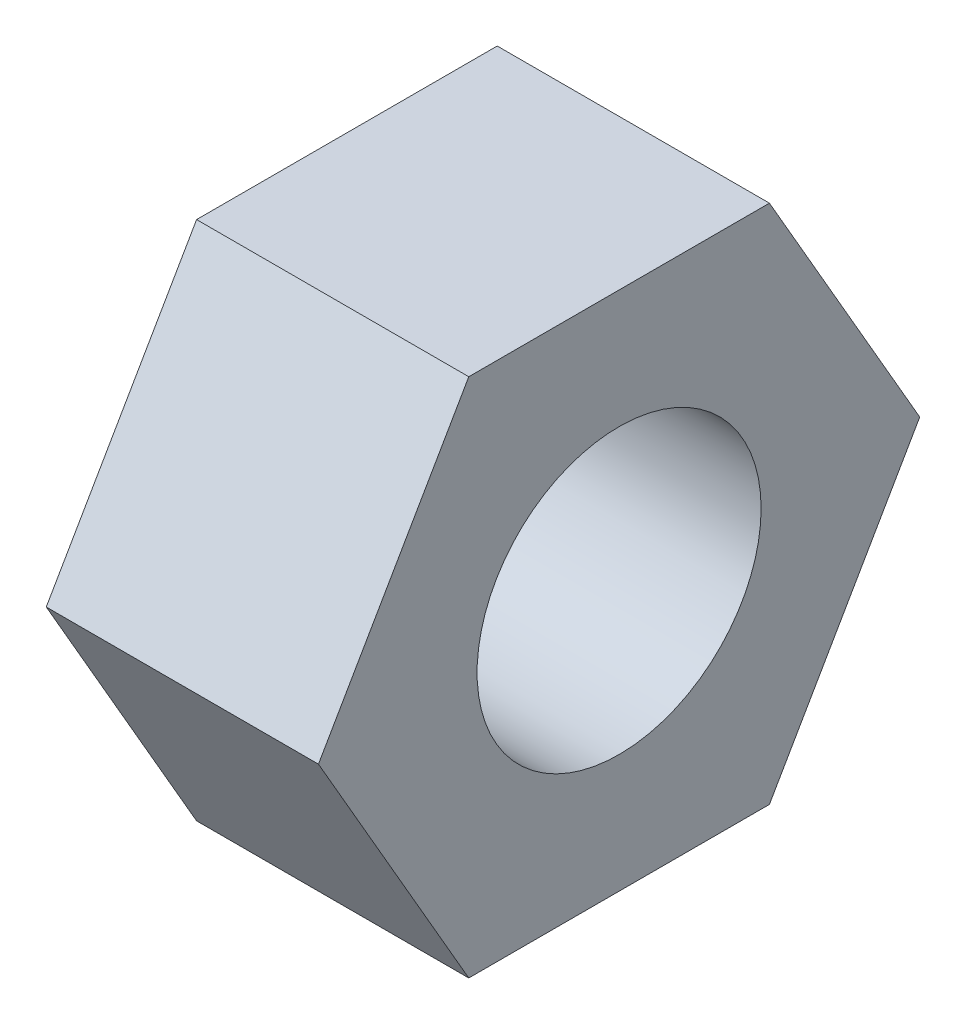
ISO-10303-21;
HEADER;
FILE_DESCRIPTION(('STEP AP214'),'2;1');
FILE_NAME('part.step','',(''),(''),'','','');
FILE_SCHEMA(('AUTOMOTIVE_DESIGN { 1 0 10303 214 1 1 1 1 }'));
ENDSEC;
DATA;
#1=APPLICATION_CONTEXT('core data for automotive mechanical design processes');
#2=APPLICATION_PROTOCOL_DEFINITION('international standard','automotive_design',2000,#1);
#3=PRODUCT_CONTEXT('',#1,'mechanical');
#4=PRODUCT('Part','Part','',(#3));
#5=PRODUCT_RELATED_PRODUCT_CATEGORY('part','',(#4));
#6=PRODUCT_DEFINITION_FORMATION('','',#4);
#7=PRODUCT_DEFINITION_CONTEXT('part definition',#1,'design');
#8=PRODUCT_DEFINITION('design','',#6,#7);
#9=PRODUCT_DEFINITION_SHAPE('','',#8);
#10=(LENGTH_UNIT() NAMED_UNIT(*) SI_UNIT(.MILLI.,.METRE.));
#11=(NAMED_UNIT(*) PLANE_ANGLE_UNIT() SI_UNIT($,.RADIAN.));
#12=(NAMED_UNIT(*) SI_UNIT($,.STERADIAN.) SOLID_ANGLE_UNIT());
#13=UNCERTAINTY_MEASURE_WITH_UNIT(LENGTH_MEASURE(1.E-05),#10,'distance_accuracy_value','');
#14=(GEOMETRIC_REPRESENTATION_CONTEXT(3) GLOBAL_UNCERTAINTY_ASSIGNED_CONTEXT((#13)) GLOBAL_UNIT_ASSIGNED_CONTEXT((#10,
#11,#12)) REPRESENTATION_CONTEXT('',''));
#15=CARTESIAN_POINT('',(0.,0.,0.));
#16=DIRECTION('',(0.,0.,1.));
#17=DIRECTION('',(1.,0.,0.));
#18=AXIS2_PLACEMENT_3D('',#15,#16,#17);
#19=CARTESIAN_POINT('',(9.128125,0.,10.0819790757238));
#20=DIRECTION('',(1.,0.,0.));
#21=DIRECTION('',(0.,0.,-1.));
#22=AXIS2_PLACEMENT_3D('',#19,#20,#21);
#23=PLANE('',#22);
#24=DIRECTION('',(0.,-0.866025403784439,0.5));
#25=VECTOR('',#24,1.);
#26=CARTESIAN_POINT('',(9.128125,8.73125,5.04098953786192));
#27=LINE('',#26,#25);
#28=CARTESIAN_POINT('',(9.128125,8.73125,5.04098953786192));
#29=VERTEX_POINT('',#28);
#30=CARTESIAN_POINT('',(9.128125,0.,10.0819790757238));
#31=VERTEX_POINT('',#30);
#32=EDGE_CURVE('E127',#29,#31,#27,.T.);
#33=ORIENTED_EDGE('',*,*,#32,.T.);
#34=DIRECTION('',(0.,-0.866025403784439,-0.5));
#35=VECTOR('',#34,1.);
#36=CARTESIAN_POINT('',(9.128125,0.,10.0819790757238));
#37=LINE('',#36,#35);
#38=CARTESIAN_POINT('',(9.128125,-8.73125,5.04098953786192));
#39=VERTEX_POINT('',#38);
#40=EDGE_CURVE('E85',#31,#39,#37,.T.);
#41=ORIENTED_EDGE('',*,*,#40,.T.);
#42=DIRECTION('',(0.,0.,-1.));
#43=VECTOR('',#42,1.);
#44=CARTESIAN_POINT('',(9.128125,-8.73125,5.04098953786192));
#45=LINE('',#44,#43);
#46=CARTESIAN_POINT('',(9.128125,-8.73125,-5.04098953786192));
#47=VERTEX_POINT('',#46);
#48=EDGE_CURVE('E98',#39,#47,#45,.T.);
#49=ORIENTED_EDGE('',*,*,#48,.T.);
#50=DIRECTION('',(0.,0.866025403784439,-0.5));
#51=VECTOR('',#50,1.);
#52=CARTESIAN_POINT('',(9.128125,-8.73125,-5.04098953786192));
#53=LINE('',#52,#51);
#54=CARTESIAN_POINT('',(9.128125,0.,-10.0819790757238));
#55=VERTEX_POINT('',#54);
#56=EDGE_CURVE('E92',#47,#55,#53,.T.);
#57=ORIENTED_EDGE('',*,*,#56,.T.);
#58=DIRECTION('',(0.,0.866025403784439,0.5));
#59=VECTOR('',#58,1.);
#60=CARTESIAN_POINT('',(9.128125,0.,-10.0819790757238));
#61=LINE('',#60,#59);
#62=CARTESIAN_POINT('',(9.128125,8.73125,-5.04098953786192));
#63=VERTEX_POINT('',#62);
#64=EDGE_CURVE('E96',#55,#63,#61,.T.);
#65=ORIENTED_EDGE('',*,*,#64,.T.);
#66=DIRECTION('',(0.,0.,1.));
#67=VECTOR('',#66,1.);
#68=CARTESIAN_POINT('',(9.128125,8.73125,-5.04098953786192));
#69=LINE('',#68,#67);
#70=EDGE_CURVE('E48',#63,#29,#69,.T.);
#71=ORIENTED_EDGE('',*,*,#70,.T.);
#72=EDGE_LOOP('',(#33,#41,#49,#57,#65,#71));
#73=FACE_BOUND('',#72,.T.);
#74=CARTESIAN_POINT('',(9.128125,0.,0.));
#75=DIRECTION('',(1.,0.,0.));
#76=DIRECTION('',(0.,0.,-1.));
#77=AXIS2_PLACEMENT_3D('',#74,#75,#76);
#78=CIRCLE('',#77,4.7625);
#79=CARTESIAN_POINT('',(9.128125,0.,-4.7625));
#80=VERTEX_POINT('',#79);
#81=EDGE_CURVE('E120',#80,#80,#78,.T.);
#82=ORIENTED_EDGE('',*,*,#81,.F.);
#83=EDGE_LOOP('',(#82));
#84=FACE_BOUND('',#83,.T.);
#85=ADVANCED_FACE('F31',(#73,#84),#23,.T.);
#86=CARTESIAN_POINT('',(0.,0.,10.0819790757238));
#87=DIRECTION('',(1.,0.,0.));
#88=DIRECTION('',(0.,0.,-1.));
#89=AXIS2_PLACEMENT_3D('',#86,#87,#88);
#90=PLANE('',#89);
#91=DIRECTION('',(0.,-0.866025403784439,0.5));
#92=VECTOR('',#91,1.);
#93=CARTESIAN_POINT('',(0.,8.73125,5.04098953786192));
#94=LINE('',#93,#92);
#95=CARTESIAN_POINT('',(0.,8.73125,5.04098953786192));
#96=VERTEX_POINT('',#95);
#97=CARTESIAN_POINT('',(0.,0.,10.0819790757238));
#98=VERTEX_POINT('',#97);
#99=EDGE_CURVE('E116',#96,#98,#94,.T.);
#100=ORIENTED_EDGE('',*,*,#99,.F.);
#101=DIRECTION('',(0.,0.,1.));
#102=VECTOR('',#101,1.);
#103=CARTESIAN_POINT('',(0.,8.73125,-5.04098953786192));
#104=LINE('',#103,#102);
#105=CARTESIAN_POINT('',(0.,8.73125,-5.04098953786192));
#106=VERTEX_POINT('',#105);
#107=EDGE_CURVE('E77',#106,#96,#104,.T.);
#108=ORIENTED_EDGE('',*,*,#107,.F.);
#109=DIRECTION('',(0.,0.866025403784439,0.5));
#110=VECTOR('',#109,1.);
#111=CARTESIAN_POINT('',(0.,0.,-10.0819790757238));
#112=LINE('',#111,#110);
#113=CARTESIAN_POINT('',(0.,0.,-10.0819790757238));
#114=VERTEX_POINT('',#113);
#115=EDGE_CURVE('E71',#114,#106,#112,.T.);
#116=ORIENTED_EDGE('',*,*,#115,.F.);
#117=DIRECTION('',(0.,0.866025403784439,-0.5));
#118=VECTOR('',#117,1.);
#119=CARTESIAN_POINT('',(0.,-8.73125,-5.04098953786192));
#120=LINE('',#119,#118);
#121=CARTESIAN_POINT('',(0.,-8.73125,-5.04098953786192));
#122=VERTEX_POINT('',#121);
#123=EDGE_CURVE('E106',#122,#114,#120,.T.);
#124=ORIENTED_EDGE('',*,*,#123,.F.);
#125=DIRECTION('',(0.,0.,-1.));
#126=VECTOR('',#125,1.);
#127=CARTESIAN_POINT('',(0.,-8.73125,5.04098953786192));
#128=LINE('',#127,#126);
#129=CARTESIAN_POINT('',(0.,-8.73125,5.04098953786192));
#130=VERTEX_POINT('',#129);
#131=EDGE_CURVE('E122',#130,#122,#128,.T.);
#132=ORIENTED_EDGE('',*,*,#131,.F.);
#133=DIRECTION('',(0.,-0.866025403784439,-0.5));
#134=VECTOR('',#133,1.);
#135=CARTESIAN_POINT('',(0.,0.,10.0819790757238));
#136=LINE('',#135,#134);
#137=EDGE_CURVE('E119',#98,#130,#136,.T.);
#138=ORIENTED_EDGE('',*,*,#137,.F.);
#139=EDGE_LOOP('',(#100,#108,#116,#124,#132,#138));
#140=FACE_BOUND('',#139,.T.);
#141=CARTESIAN_POINT('',(0.,0.,0.));
#142=DIRECTION('',(1.,0.,0.));
#143=DIRECTION('',(0.,0.,-1.));
#144=AXIS2_PLACEMENT_3D('',#141,#142,#143);
#145=CIRCLE('',#144,4.7625);
#146=CARTESIAN_POINT('',(0.,0.,-4.7625));
#147=VERTEX_POINT('',#146);
#148=EDGE_CURVE('E220',#147,#147,#145,.T.);
#149=ORIENTED_EDGE('',*,*,#148,.T.);
#150=EDGE_LOOP('',(#149));
#151=FACE_BOUND('',#150,.T.);
#152=ADVANCED_FACE('F136',(#140,#151),#90,.F.);
#153=CARTESIAN_POINT('',(9.128125,8.73125,5.04098953786192));
#154=DIRECTION('',(0.,-0.5,-0.866025403784439));
#155=DIRECTION('',(0.,0.866025403784439,-0.5));
#156=AXIS2_PLACEMENT_3D('',#153,#154,#155);
#157=PLANE('',#156);
#158=ORIENTED_EDGE('',*,*,#99,.T.);
#159=DIRECTION('',(-1.,0.,0.));
#160=VECTOR('',#159,1.);
#161=CARTESIAN_POINT('',(9.128125,0.,10.0819790757238));
#162=LINE('',#161,#160);
#163=EDGE_CURVE('E11',#31,#98,#162,.T.);
#164=ORIENTED_EDGE('',*,*,#163,.F.);
#165=ORIENTED_EDGE('',*,*,#32,.F.);
#166=DIRECTION('',(-1.,0.,0.));
#167=VECTOR('',#166,1.);
#168=CARTESIAN_POINT('',(9.128125,8.73125,5.04098953786192));
#169=LINE('',#168,#167);
#170=EDGE_CURVE('E112',#29,#96,#169,.T.);
#171=ORIENTED_EDGE('',*,*,#170,.T.);
#172=EDGE_LOOP('',(#158,#164,#165,#171));
#173=FACE_BOUND('',#172,.T.);
#174=ADVANCED_FACE('F33',(#173),#157,.F.);
#175=CARTESIAN_POINT('',(9.128125,0.,10.0819790757238));
#176=DIRECTION('',(0.,0.5,-0.866025403784439));
#177=DIRECTION('',(0.,0.866025403784439,0.5));
#178=AXIS2_PLACEMENT_3D('',#175,#176,#177);
#179=PLANE('',#178);
#180=ORIENTED_EDGE('',*,*,#137,.T.);
#181=DIRECTION('',(-1.,0.,0.));
#182=VECTOR('',#181,1.);
#183=CARTESIAN_POINT('',(9.128125,-8.73125,5.04098953786192));
#184=LINE('',#183,#182);
#185=EDGE_CURVE('E40',#39,#130,#184,.T.);
#186=ORIENTED_EDGE('',*,*,#185,.F.);
#187=ORIENTED_EDGE('',*,*,#40,.F.);
#188=ORIENTED_EDGE('',*,*,#163,.T.);
#189=EDGE_LOOP('',(#180,#186,#187,#188));
#190=FACE_BOUND('',#189,.T.);
#191=ADVANCED_FACE('F161',(#190),#179,.F.);
#192=CARTESIAN_POINT('',(9.128125,-8.73125,5.04098953786192));
#193=DIRECTION('',(0.,1.,0.));
#194=DIRECTION('',(0.,0.,1.));
#195=AXIS2_PLACEMENT_3D('',#192,#193,#194);
#196=PLANE('',#195);
#197=ORIENTED_EDGE('',*,*,#131,.T.);
#198=DIRECTION('',(-1.,0.,0.));
#199=VECTOR('',#198,1.);
#200=CARTESIAN_POINT('',(9.128125,-8.73125,-5.04098953786192));
#201=LINE('',#200,#199);
#202=EDGE_CURVE('E107',#47,#122,#201,.T.);
#203=ORIENTED_EDGE('',*,*,#202,.F.);
#204=ORIENTED_EDGE('',*,*,#48,.F.);
#205=ORIENTED_EDGE('',*,*,#185,.T.);
#206=EDGE_LOOP('',(#197,#203,#204,#205));
#207=FACE_BOUND('',#206,.T.);
#208=ADVANCED_FACE('F133',(#207),#196,.F.);
#209=CARTESIAN_POINT('',(9.128125,-8.73125,-5.04098953786192));
#210=DIRECTION('',(0.,0.5,0.866025403784439));
#211=DIRECTION('',(0.,-0.866025403784439,0.5));
#212=AXIS2_PLACEMENT_3D('',#209,#210,#211);
#213=PLANE('',#212);
#214=ORIENTED_EDGE('',*,*,#123,.T.);
#215=DIRECTION('',(-1.,0.,0.));
#216=VECTOR('',#215,1.);
#217=CARTESIAN_POINT('',(9.128125,0.,-10.0819790757238));
#218=LINE('',#217,#216);
#219=EDGE_CURVE('E103',#55,#114,#218,.T.);
#220=ORIENTED_EDGE('',*,*,#219,.F.);
#221=ORIENTED_EDGE('',*,*,#56,.F.);
#222=ORIENTED_EDGE('',*,*,#202,.T.);
#223=EDGE_LOOP('',(#214,#220,#221,#222));
#224=FACE_BOUND('',#223,.T.);
#225=ADVANCED_FACE('F104',(#224),#213,.F.);
#226=CARTESIAN_POINT('',(9.128125,0.,-10.0819790757238));
#227=DIRECTION('',(0.,-0.5,0.866025403784439));
#228=DIRECTION('',(0.,-0.866025403784439,-0.5));
#229=AXIS2_PLACEMENT_3D('',#226,#227,#228);
#230=PLANE('',#229);
#231=ORIENTED_EDGE('',*,*,#115,.T.);
#232=DIRECTION('',(-1.,0.,0.));
#233=VECTOR('',#232,1.);
#234=CARTESIAN_POINT('',(9.128125,8.73125,-5.04098953786192));
#235=LINE('',#234,#233);
#236=EDGE_CURVE('E108',#63,#106,#235,.T.);
#237=ORIENTED_EDGE('',*,*,#236,.F.);
#238=ORIENTED_EDGE('',*,*,#64,.F.);
#239=ORIENTED_EDGE('',*,*,#219,.T.);
#240=EDGE_LOOP('',(#231,#237,#238,#239));
#241=FACE_BOUND('',#240,.T.);
#242=ADVANCED_FACE('F110',(#241),#230,.F.);
#243=CARTESIAN_POINT('',(9.128125,8.73125,-5.04098953786192));
#244=DIRECTION('',(0.,-1.,0.));
#245=DIRECTION('',(0.,0.,-1.));
#246=AXIS2_PLACEMENT_3D('',#243,#244,#245);
#247=PLANE('',#246);
#248=ORIENTED_EDGE('',*,*,#107,.T.);
#249=ORIENTED_EDGE('',*,*,#170,.F.);
#250=ORIENTED_EDGE('',*,*,#70,.F.);
#251=ORIENTED_EDGE('',*,*,#236,.T.);
#252=EDGE_LOOP('',(#248,#249,#250,#251));
#253=FACE_BOUND('',#252,.T.);
#254=ADVANCED_FACE('F141',(#253),#247,.F.);
#255=CARTESIAN_POINT('',(9.128125,0.,0.));
#256=DIRECTION('',(-1.,0.,0.));
#257=DIRECTION('',(0.,0.,1.));
#258=AXIS2_PLACEMENT_3D('',#255,#256,#257);
#259=CYLINDRICAL_SURFACE('',#258,4.7625);
#260=ORIENTED_EDGE('',*,*,#81,.T.);
#261=EDGE_LOOP('',(#260));
#262=FACE_BOUND('',#261,.T.);
#263=ORIENTED_EDGE('',*,*,#148,.F.);
#264=EDGE_LOOP('',(#263));
#265=FACE_BOUND('',#264,.T.);
#266=ADVANCED_FACE('F143',(#262,#265),#259,.F.);
#267=CLOSED_SHELL('',(#85,#152,#174,#191,#208,#225,#242,#254,#266));
#268=MANIFOLD_SOLID_BREP('B2',#267);
#269=ADVANCED_BREP_SHAPE_REPRESENTATION('',(#18,#268),#14);
#270=SHAPE_DEFINITION_REPRESENTATION(#9,#269);
ENDSEC;
END-ISO-10303-21;
